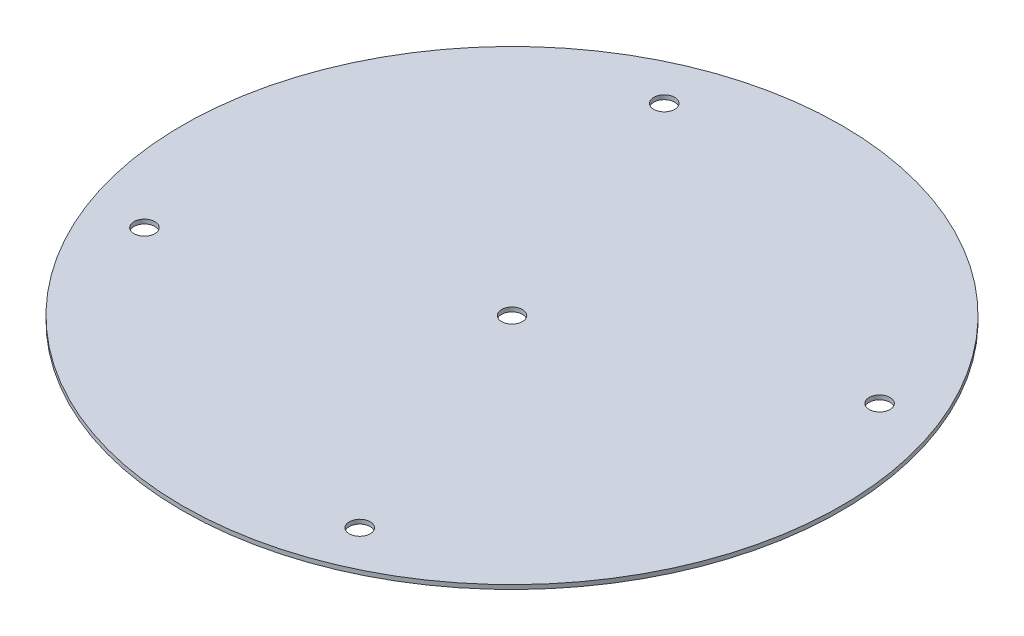
ISO-10303-21;
HEADER;
FILE_DESCRIPTION(('STEP AP214'),'2;1');
FILE_NAME('part.step','',(''),(''),'','','');
FILE_SCHEMA(('AUTOMOTIVE_DESIGN { 1 0 10303 214 1 1 1 1 }'));
ENDSEC;
DATA;
#1=APPLICATION_CONTEXT('core data for automotive mechanical design processes');
#2=APPLICATION_PROTOCOL_DEFINITION('international standard','automotive_design',2000,#1);
#3=PRODUCT_CONTEXT('',#1,'mechanical');
#4=PRODUCT('Part','Part','',(#3));
#5=PRODUCT_RELATED_PRODUCT_CATEGORY('part','',(#4));
#6=PRODUCT_DEFINITION_FORMATION('','',#4);
#7=PRODUCT_DEFINITION_CONTEXT('part definition',#1,'design');
#8=PRODUCT_DEFINITION('design','',#6,#7);
#9=PRODUCT_DEFINITION_SHAPE('','',#8);
#10=(LENGTH_UNIT() NAMED_UNIT(*) SI_UNIT(.MILLI.,.METRE.));
#11=(NAMED_UNIT(*) PLANE_ANGLE_UNIT() SI_UNIT($,.RADIAN.));
#12=(NAMED_UNIT(*) SI_UNIT($,.STERADIAN.) SOLID_ANGLE_UNIT());
#13=UNCERTAINTY_MEASURE_WITH_UNIT(LENGTH_MEASURE(1.E-05),#10,'distance_accuracy_value','');
#14=(GEOMETRIC_REPRESENTATION_CONTEXT(3) GLOBAL_UNCERTAINTY_ASSIGNED_CONTEXT((#13)) GLOBAL_UNIT_ASSIGNED_CONTEXT((#10,
#11,#12)) REPRESENTATION_CONTEXT('',''));
#15=CARTESIAN_POINT('',(0.,0.,0.));
#16=DIRECTION('',(0.,0.,1.));
#17=DIRECTION('',(1.,0.,0.));
#18=AXIS2_PLACEMENT_3D('',#15,#16,#17);
#19=CARTESIAN_POINT('',(0.,0.,0.));
#20=DIRECTION('',(0.,1.,0.));
#21=DIRECTION('',(0.,0.,1.));
#22=AXIS2_PLACEMENT_3D('',#19,#20,#21);
#23=PLANE('',#22);
#24=CARTESIAN_POINT('',(0.,0.,0.));
#25=DIRECTION('',(0.,1.,0.));
#26=DIRECTION('',(0.,0.,1.));
#27=AXIS2_PLACEMENT_3D('',#24,#25,#26);
#28=CIRCLE('',#27,2.45745);
#29=CARTESIAN_POINT('',(0.,0.,2.45745));
#30=VERTEX_POINT('',#29);
#31=EDGE_CURVE('E70',#30,#30,#28,.T.);
#32=ORIENTED_EDGE('',*,*,#31,.T.);
#33=EDGE_LOOP('',(#32));
#34=FACE_BOUND('',#33,.T.);
#35=CARTESIAN_POINT('',(61.1608250522469,0.,-25.3336432225696));
#36=DIRECTION('',(0.,1.,0.));
#37=DIRECTION('',(0.,0.,1.));
#38=AXIS2_PLACEMENT_3D('',#35,#36,#37);
#39=CIRCLE('',#38,2.45744999999999);
#40=CARTESIAN_POINT('',(61.1608250522469,0.,-22.8761932225696));
#41=VERTEX_POINT('',#40);
#42=EDGE_CURVE('E64',#41,#41,#39,.T.);
#43=ORIENTED_EDGE('',*,*,#42,.T.);
#44=EDGE_LOOP('',(#43));
#45=FACE_BOUND('',#44,.T.);
#46=CARTESIAN_POINT('',(25.333643222569,0.,61.1608250522472));
#47=DIRECTION('',(0.,1.,0.));
#48=DIRECTION('',(0.,0.,1.));
#49=AXIS2_PLACEMENT_3D('',#46,#47,#48);
#50=CIRCLE('',#49,2.45745);
#51=CARTESIAN_POINT('',(25.333643222569,0.,63.6182750522472));
#52=VERTEX_POINT('',#51);
#53=EDGE_CURVE('E58',#52,#52,#50,.T.);
#54=ORIENTED_EDGE('',*,*,#53,.T.);
#55=EDGE_LOOP('',(#54));
#56=FACE_BOUND('',#55,.T.);
#57=CARTESIAN_POINT('',(-61.1608250522471,0.,25.3336432225692));
#58=DIRECTION('',(0.,1.,0.));
#59=DIRECTION('',(0.,0.,1.));
#60=AXIS2_PLACEMENT_3D('',#57,#58,#59);
#61=CIRCLE('',#60,2.45745);
#62=CARTESIAN_POINT('',(-61.1608250522471,0.,27.7910932225692));
#63=VERTEX_POINT('',#62);
#64=EDGE_CURVE('E52',#63,#63,#61,.T.);
#65=ORIENTED_EDGE('',*,*,#64,.T.);
#66=EDGE_LOOP('',(#65));
#67=FACE_BOUND('',#66,.T.);
#68=CARTESIAN_POINT('',(-25.333643222569,0.,-61.1608250522472));
#69=DIRECTION('',(0.,1.,0.));
#70=DIRECTION('',(0.,0.,1.));
#71=AXIS2_PLACEMENT_3D('',#68,#69,#70);
#72=CIRCLE('',#71,2.45745);
#73=CARTESIAN_POINT('',(-25.333643222569,0.,-58.7033750522472));
#74=VERTEX_POINT('',#73);
#75=EDGE_CURVE('E43',#74,#74,#72,.T.);
#76=ORIENTED_EDGE('',*,*,#75,.T.);
#77=EDGE_LOOP('',(#76));
#78=FACE_BOUND('',#77,.T.);
#79=CARTESIAN_POINT('',(0.,0.,0.));
#80=DIRECTION('',(0.,-1.,0.));
#81=DIRECTION('',(0.,0.,-1.));
#82=AXIS2_PLACEMENT_3D('',#79,#80,#81);
#83=CIRCLE('',#82,77.55);
#84=CARTESIAN_POINT('',(0.,0.,-77.55));
#85=VERTEX_POINT('',#84);
#86=EDGE_CURVE('E10',#85,#85,#83,.T.);
#87=ORIENTED_EDGE('',*,*,#86,.T.);
#88=EDGE_LOOP('',(#87));
#89=FACE_BOUND('',#88,.T.);
#90=ADVANCED_FACE('F33',(#34,#45,#56,#67,#78,#89),#23,.F.);
#91=CARTESIAN_POINT('',(0.,-0.0500000000000096,0.));
#92=DIRECTION('',(0.,-1.,0.));
#93=DIRECTION('',(0.,0.,-1.));
#94=AXIS2_PLACEMENT_3D('',#91,#92,#93);
#95=CYLINDRICAL_SURFACE('',#94,77.55);
#96=ORIENTED_EDGE('',*,*,#86,.F.);
#97=EDGE_LOOP('',(#96));
#98=FACE_BOUND('',#97,.T.);
#99=CARTESIAN_POINT('',(0.,0.99999999999999,0.));
#100=DIRECTION('',(0.,-1.,0.));
#101=DIRECTION('',(0.,0.,-1.));
#102=AXIS2_PLACEMENT_3D('',#99,#100,#101);
#103=CIRCLE('',#102,77.55);
#104=CARTESIAN_POINT('',(0.,0.99999999999999,-77.55));
#105=VERTEX_POINT('',#104);
#106=EDGE_CURVE('E39',#105,#105,#103,.T.);
#107=ORIENTED_EDGE('',*,*,#106,.T.);
#108=EDGE_LOOP('',(#107));
#109=FACE_BOUND('',#108,.T.);
#110=ADVANCED_FACE('F83',(#98,#109),#95,.T.);
#111=CARTESIAN_POINT('',(0.,0.99999999999999,77.55));
#112=DIRECTION('',(0.,-1.,0.));
#113=DIRECTION('',(0.,0.,-1.));
#114=AXIS2_PLACEMENT_3D('',#111,#112,#113);
#115=PLANE('',#114);
#116=CARTESIAN_POINT('',(0.,0.99999999999999,0.));
#117=DIRECTION('',(0.,1.,0.));
#118=DIRECTION('',(0.,0.,1.));
#119=AXIS2_PLACEMENT_3D('',#116,#117,#118);
#120=CIRCLE('',#119,2.45745);
#121=CARTESIAN_POINT('',(0.,0.99999999999999,2.45745));
#122=VERTEX_POINT('',#121);
#123=EDGE_CURVE('E73',#122,#122,#120,.T.);
#124=ORIENTED_EDGE('',*,*,#123,.F.);
#125=EDGE_LOOP('',(#124));
#126=FACE_BOUND('',#125,.T.);
#127=CARTESIAN_POINT('',(61.1608250522469,0.99999999999999,-25.3336432225696));
#128=DIRECTION('',(0.,1.,0.));
#129=DIRECTION('',(0.,0.,1.));
#130=AXIS2_PLACEMENT_3D('',#127,#128,#129);
#131=CIRCLE('',#130,2.45744999999999);
#132=CARTESIAN_POINT('',(61.1608250522469,0.99999999999999,-22.8761932225696));
#133=VERTEX_POINT('',#132);
#134=EDGE_CURVE('E67',#133,#133,#131,.T.);
#135=ORIENTED_EDGE('',*,*,#134,.F.);
#136=EDGE_LOOP('',(#135));
#137=FACE_BOUND('',#136,.T.);
#138=CARTESIAN_POINT('',(25.333643222569,0.99999999999999,61.1608250522472));
#139=DIRECTION('',(0.,1.,0.));
#140=DIRECTION('',(0.,0.,1.));
#141=AXIS2_PLACEMENT_3D('',#138,#139,#140);
#142=CIRCLE('',#141,2.45745);
#143=CARTESIAN_POINT('',(25.333643222569,0.99999999999999,63.6182750522472));
#144=VERTEX_POINT('',#143);
#145=EDGE_CURVE('E61',#144,#144,#142,.T.);
#146=ORIENTED_EDGE('',*,*,#145,.F.);
#147=EDGE_LOOP('',(#146));
#148=FACE_BOUND('',#147,.T.);
#149=CARTESIAN_POINT('',(-61.1608250522471,0.99999999999999,25.3336432225692));
#150=DIRECTION('',(0.,1.,0.));
#151=DIRECTION('',(0.,0.,1.));
#152=AXIS2_PLACEMENT_3D('',#149,#150,#151);
#153=CIRCLE('',#152,2.45745);
#154=CARTESIAN_POINT('',(-61.1608250522471,0.99999999999999,27.7910932225692));
#155=VERTEX_POINT('',#154);
#156=EDGE_CURVE('E55',#155,#155,#153,.T.);
#157=ORIENTED_EDGE('',*,*,#156,.F.);
#158=EDGE_LOOP('',(#157));
#159=FACE_BOUND('',#158,.T.);
#160=CARTESIAN_POINT('',(-25.333643222569,0.99999999999999,-61.1608250522472));
#161=DIRECTION('',(0.,1.,0.));
#162=DIRECTION('',(0.,0.,1.));
#163=AXIS2_PLACEMENT_3D('',#160,#161,#162);
#164=CIRCLE('',#163,2.45745);
#165=CARTESIAN_POINT('',(-25.333643222569,0.99999999999999,-58.7033750522472));
#166=VERTEX_POINT('',#165);
#167=EDGE_CURVE('E47',#166,#166,#164,.T.);
#168=ORIENTED_EDGE('',*,*,#167,.F.);
#169=EDGE_LOOP('',(#168));
#170=FACE_BOUND('',#169,.T.);
#171=ORIENTED_EDGE('',*,*,#106,.F.);
#172=EDGE_LOOP('',(#171));
#173=FACE_BOUND('',#172,.T.);
#174=ADVANCED_FACE('F79',(#126,#137,#148,#159,#170,#173),#115,.F.);
#175=CARTESIAN_POINT('',(-25.333643222569,0.99999999999999,-61.1608250522472));
#176=DIRECTION('',(0.,1.,0.));
#177=DIRECTION('',(0.,0.,1.));
#178=AXIS2_PLACEMENT_3D('',#175,#176,#177);
#179=CYLINDRICAL_SURFACE('',#178,2.45745);
#180=ORIENTED_EDGE('',*,*,#75,.F.);
#181=EDGE_LOOP('',(#180));
#182=FACE_BOUND('',#181,.T.);
#183=ORIENTED_EDGE('',*,*,#167,.T.);
#184=EDGE_LOOP('',(#183));
#185=FACE_BOUND('',#184,.T.);
#186=ADVANCED_FACE('F82',(#182,#185),#179,.F.);
#187=CARTESIAN_POINT('',(-61.1608250522471,0.99999999999999,25.3336432225692));
#188=DIRECTION('',(0.,1.,0.));
#189=DIRECTION('',(0.,0.,1.));
#190=AXIS2_PLACEMENT_3D('',#187,#188,#189);
#191=CYLINDRICAL_SURFACE('',#190,2.45745);
#192=ORIENTED_EDGE('',*,*,#64,.F.);
#193=EDGE_LOOP('',(#192));
#194=FACE_BOUND('',#193,.T.);
#195=ORIENTED_EDGE('',*,*,#156,.T.);
#196=EDGE_LOOP('',(#195));
#197=FACE_BOUND('',#196,.T.);
#198=ADVANCED_FACE('F95',(#194,#197),#191,.F.);
#199=CARTESIAN_POINT('',(25.333643222569,0.99999999999999,61.1608250522472));
#200=DIRECTION('',(0.,1.,0.));
#201=DIRECTION('',(0.,0.,1.));
#202=AXIS2_PLACEMENT_3D('',#199,#200,#201);
#203=CYLINDRICAL_SURFACE('',#202,2.45745);
#204=ORIENTED_EDGE('',*,*,#53,.F.);
#205=EDGE_LOOP('',(#204));
#206=FACE_BOUND('',#205,.T.);
#207=ORIENTED_EDGE('',*,*,#145,.T.);
#208=EDGE_LOOP('',(#207));
#209=FACE_BOUND('',#208,.T.);
#210=ADVANCED_FACE('F101',(#206,#209),#203,.F.);
#211=CARTESIAN_POINT('',(61.1608250522469,0.99999999999999,-25.3336432225696));
#212=DIRECTION('',(0.,1.,0.));
#213=DIRECTION('',(0.,0.,1.));
#214=AXIS2_PLACEMENT_3D('',#211,#212,#213);
#215=CYLINDRICAL_SURFACE('',#214,2.45744999999999);
#216=ORIENTED_EDGE('',*,*,#42,.F.);
#217=EDGE_LOOP('',(#216));
#218=FACE_BOUND('',#217,.T.);
#219=ORIENTED_EDGE('',*,*,#134,.T.);
#220=EDGE_LOOP('',(#219));
#221=FACE_BOUND('',#220,.T.);
#222=ADVANCED_FACE('F123',(#218,#221),#215,.F.);
#223=CARTESIAN_POINT('',(0.,0.99999999999999,0.));
#224=DIRECTION('',(0.,1.,0.));
#225=DIRECTION('',(0.,0.,1.));
#226=AXIS2_PLACEMENT_3D('',#223,#224,#225);
#227=CYLINDRICAL_SURFACE('',#226,2.45745);
#228=ORIENTED_EDGE('',*,*,#31,.F.);
#229=EDGE_LOOP('',(#228));
#230=FACE_BOUND('',#229,.T.);
#231=ORIENTED_EDGE('',*,*,#123,.T.);
#232=EDGE_LOOP('',(#231));
#233=FACE_BOUND('',#232,.T.);
#234=ADVANCED_FACE('F77',(#230,#233),#227,.F.);
#235=CLOSED_SHELL('',(#90,#110,#174,#186,#198,#210,#222,#234));
#236=MANIFOLD_SOLID_BREP('B2',#235);
#237=ADVANCED_BREP_SHAPE_REPRESENTATION('',(#18,#236),#14);
#238=SHAPE_DEFINITION_REPRESENTATION(#9,#237);
ENDSEC;
END-ISO-10303-21;
